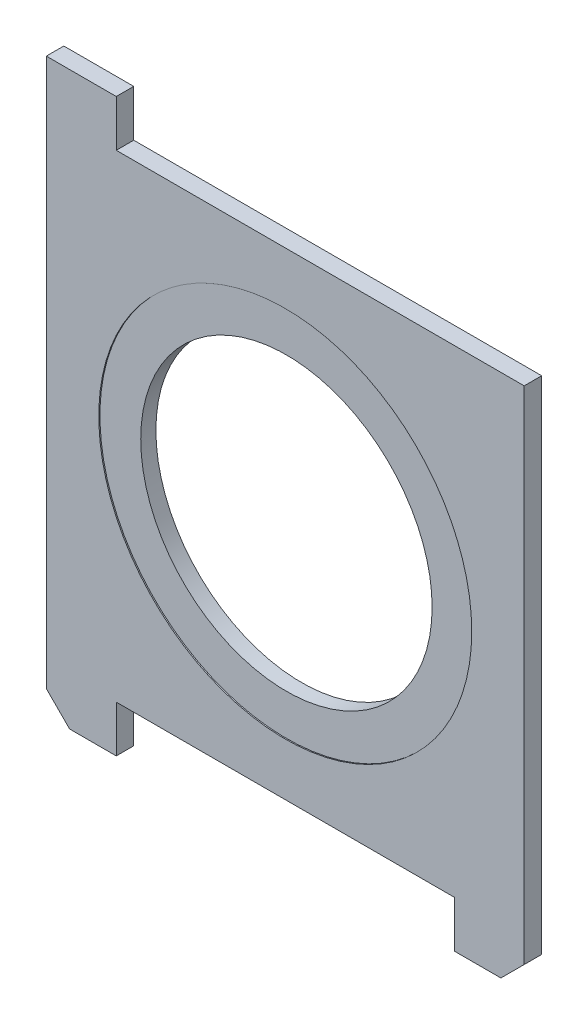
ISO-10303-21;
HEADER;
FILE_DESCRIPTION(('STEP AP214'),'2;1');
FILE_NAME('part.step','',(''),(''),'','','');
FILE_SCHEMA(('AUTOMOTIVE_DESIGN { 1 0 10303 214 1 1 1 1 }'));
ENDSEC;
DATA;
#1=APPLICATION_CONTEXT('core data for automotive mechanical design processes');
#2=APPLICATION_PROTOCOL_DEFINITION('international standard','automotive_design',2000,#1);
#3=PRODUCT_CONTEXT('',#1,'mechanical');
#4=PRODUCT('Part','Part','',(#3));
#5=PRODUCT_RELATED_PRODUCT_CATEGORY('part','',(#4));
#6=PRODUCT_DEFINITION_FORMATION('','',#4);
#7=PRODUCT_DEFINITION_CONTEXT('part definition',#1,'design');
#8=PRODUCT_DEFINITION('design','',#6,#7);
#9=PRODUCT_DEFINITION_SHAPE('','',#8);
#10=(LENGTH_UNIT() NAMED_UNIT(*) SI_UNIT(.MILLI.,.METRE.));
#11=(NAMED_UNIT(*) PLANE_ANGLE_UNIT() SI_UNIT($,.RADIAN.));
#12=(NAMED_UNIT(*) SI_UNIT($,.STERADIAN.) SOLID_ANGLE_UNIT());
#13=UNCERTAINTY_MEASURE_WITH_UNIT(LENGTH_MEASURE(1.E-05),#10,'distance_accuracy_value','');
#14=(GEOMETRIC_REPRESENTATION_CONTEXT(3) GLOBAL_UNCERTAINTY_ASSIGNED_CONTEXT((#13)) GLOBAL_UNIT_ASSIGNED_CONTEXT((#10,
#11,#12)) REPRESENTATION_CONTEXT('',''));
#15=CARTESIAN_POINT('',(0.,0.,0.));
#16=DIRECTION('',(0.,0.,1.));
#17=DIRECTION('',(1.,0.,0.));
#18=AXIS2_PLACEMENT_3D('',#15,#16,#17);
#19=CARTESIAN_POINT('',(0.,0.,1.5));
#20=DIRECTION('',(0.,0.,-1.));
#21=DIRECTION('',(-1.,0.,0.));
#22=AXIS2_PLACEMENT_3D('',#19,#20,#21);
#23=CYLINDRICAL_SURFACE('',#22,12.5);
#24=CARTESIAN_POINT('',(0.,0.,0.1));
#25=DIRECTION('',(0.,0.,-1.));
#26=DIRECTION('',(-1.,0.,0.));
#27=AXIS2_PLACEMENT_3D('',#24,#25,#26);
#28=CIRCLE('',#27,12.5);
#29=CARTESIAN_POINT('',(-12.5,0.,0.1));
#30=VERTEX_POINT('',#29);
#31=EDGE_CURVE('E153',#30,#30,#28,.F.);
#32=ORIENTED_EDGE('',*,*,#31,.F.);
#33=EDGE_LOOP('',(#32));
#34=FACE_BOUND('',#33,.T.);
#35=CARTESIAN_POINT('',(0.,0.,1.4));
#36=DIRECTION('',(0.,0.,1.));
#37=DIRECTION('',(1.,0.,0.));
#38=AXIS2_PLACEMENT_3D('',#35,#36,#37);
#39=CIRCLE('',#38,12.5);
#40=CARTESIAN_POINT('',(12.5,0.,1.4));
#41=VERTEX_POINT('',#40);
#42=EDGE_CURVE('E214',#41,#41,#39,.F.);
#43=ORIENTED_EDGE('',*,*,#42,.F.);
#44=EDGE_LOOP('',(#43));
#45=FACE_BOUND('',#44,.T.);
#46=ADVANCED_FACE('F38',(#34,#45),#23,.F.);
#47=CARTESIAN_POINT('',(-20.5,-20.5,1.5));
#48=DIRECTION('',(0.,1.,0.));
#49=DIRECTION('',(0.,0.,1.));
#50=AXIS2_PLACEMENT_3D('',#47,#48,#49);
#51=PLANE('',#50);
#52=DIRECTION('',(1.,0.,0.));
#53=VECTOR('',#52,1.);
#54=CARTESIAN_POINT('',(-20.5,-20.5,1.5));
#55=LINE('',#54,#53);
#56=CARTESIAN_POINT('',(-14.5,-20.5,1.5));
#57=VERTEX_POINT('',#56);
#58=CARTESIAN_POINT('',(14.5,-20.5,1.5));
#59=VERTEX_POINT('',#58);
#60=EDGE_CURVE('E144',#57,#59,#55,.T.);
#61=ORIENTED_EDGE('',*,*,#60,.F.);
#62=DIRECTION('',(0.,0.,-1.));
#63=VECTOR('',#62,1.);
#64=CARTESIAN_POINT('',(-14.5,-20.5,8.71110255092798));
#65=LINE('',#64,#63);
#66=CARTESIAN_POINT('',(-14.5,-20.5,0.));
#67=VERTEX_POINT('',#66);
#68=EDGE_CURVE('E142',#57,#67,#65,.T.);
#69=ORIENTED_EDGE('',*,*,#68,.T.);
#70=DIRECTION('',(1.,0.,0.));
#71=VECTOR('',#70,1.);
#72=CARTESIAN_POINT('',(-20.5,-20.5,0.));
#73=LINE('',#72,#71);
#74=CARTESIAN_POINT('',(14.5,-20.5,0.));
#75=VERTEX_POINT('',#74);
#76=EDGE_CURVE('E126',#67,#75,#73,.T.);
#77=ORIENTED_EDGE('',*,*,#76,.T.);
#78=DIRECTION('',(0.,0.,-1.));
#79=VECTOR('',#78,1.);
#80=CARTESIAN_POINT('',(14.5,-20.5,8.71110255092798));
#81=LINE('',#80,#79);
#82=EDGE_CURVE('E168',#59,#75,#81,.T.);
#83=ORIENTED_EDGE('',*,*,#82,.F.);
#84=EDGE_LOOP('',(#61,#69,#77,#83));
#85=FACE_BOUND('',#84,.T.);
#86=ADVANCED_FACE('F143',(#85),#51,.F.);
#87=CARTESIAN_POINT('',(-20.5,20.5,1.5));
#88=DIRECTION('',(0.,-1.,0.));
#89=DIRECTION('',(0.,0.,-1.));
#90=AXIS2_PLACEMENT_3D('',#87,#88,#89);
#91=PLANE('',#90);
#92=DIRECTION('',(0.,0.,-1.));
#93=VECTOR('',#92,1.);
#94=CARTESIAN_POINT('',(-14.5,20.5,8.71110255092798));
#95=LINE('',#94,#93);
#96=CARTESIAN_POINT('',(-14.5,20.5,1.5));
#97=VERTEX_POINT('',#96);
#98=CARTESIAN_POINT('',(-14.5,20.5,0.));
#99=VERTEX_POINT('',#98);
#100=EDGE_CURVE('E181',#97,#99,#95,.T.);
#101=ORIENTED_EDGE('',*,*,#100,.F.);
#102=DIRECTION('',(-1.,0.,0.));
#103=VECTOR('',#102,1.);
#104=CARTESIAN_POINT('',(-20.5,20.5,1.5));
#105=LINE('',#104,#103);
#106=CARTESIAN_POINT('',(20.5,20.5,1.5));
#107=VERTEX_POINT('',#106);
#108=EDGE_CURVE('E198',#107,#97,#105,.T.);
#109=ORIENTED_EDGE('',*,*,#108,.F.);
#110=DIRECTION('',(0.,0.,-1.));
#111=VECTOR('',#110,1.);
#112=CARTESIAN_POINT('',(20.5,20.5,1.5));
#113=LINE('',#112,#111);
#114=CARTESIAN_POINT('',(20.5,20.5,0.));
#115=VERTEX_POINT('',#114);
#116=EDGE_CURVE('E205',#107,#115,#113,.T.);
#117=ORIENTED_EDGE('',*,*,#116,.T.);
#118=DIRECTION('',(-1.,0.,0.));
#119=VECTOR('',#118,1.);
#120=CARTESIAN_POINT('',(-20.5,20.5,0.));
#121=LINE('',#120,#119);
#122=EDGE_CURVE('E207',#115,#99,#121,.T.);
#123=ORIENTED_EDGE('',*,*,#122,.T.);
#124=EDGE_LOOP('',(#101,#109,#117,#123));
#125=FACE_BOUND('',#124,.T.);
#126=ADVANCED_FACE('F241',(#125),#91,.F.);
#127=CARTESIAN_POINT('',(20.5,-20.5,1.5));
#128=DIRECTION('',(-1.,0.,0.));
#129=DIRECTION('',(0.,0.,1.));
#130=AXIS2_PLACEMENT_3D('',#127,#128,#129);
#131=PLANE('',#130);
#132=DIRECTION('',(0.,1.,0.));
#133=VECTOR('',#132,1.);
#134=CARTESIAN_POINT('',(20.5,-20.5,1.5));
#135=LINE('',#134,#133);
#136=CARTESIAN_POINT('',(20.5,-22.5,1.5));
#137=VERTEX_POINT('',#136);
#138=EDGE_CURVE('E138',#137,#107,#135,.T.);
#139=ORIENTED_EDGE('',*,*,#138,.F.);
#140=DIRECTION('',(0.,0.,-1.));
#141=VECTOR('',#140,1.);
#142=CARTESIAN_POINT('',(20.5,-22.5,0.));
#143=LINE('',#142,#141);
#144=CARTESIAN_POINT('',(20.5,-22.5,0.));
#145=VERTEX_POINT('',#144);
#146=EDGE_CURVE('E227',#137,#145,#143,.T.);
#147=ORIENTED_EDGE('',*,*,#146,.T.);
#148=DIRECTION('',(0.,1.,0.));
#149=VECTOR('',#148,1.);
#150=CARTESIAN_POINT('',(20.5,-20.5,0.));
#151=LINE('',#150,#149);
#152=EDGE_CURVE('E196',#145,#115,#151,.T.);
#153=ORIENTED_EDGE('',*,*,#152,.T.);
#154=ORIENTED_EDGE('',*,*,#116,.F.);
#155=EDGE_LOOP('',(#139,#147,#153,#154));
#156=FACE_BOUND('',#155,.T.);
#157=ADVANCED_FACE('F233',(#156),#131,.F.);
#158=CARTESIAN_POINT('',(-20.5,-20.5,1.5));
#159=DIRECTION('',(1.,0.,0.));
#160=DIRECTION('',(0.,0.,-1.));
#161=AXIS2_PLACEMENT_3D('',#158,#159,#160);
#162=PLANE('',#161);
#163=DIRECTION('',(0.,-1.,0.));
#164=VECTOR('',#163,1.);
#165=CARTESIAN_POINT('',(-20.5,-20.5,0.));
#166=LINE('',#165,#164);
#167=CARTESIAN_POINT('',(-20.5,24.5,0.));
#168=VERTEX_POINT('',#167);
#169=CARTESIAN_POINT('',(-20.5,-22.5,0.));
#170=VERTEX_POINT('',#169);
#171=EDGE_CURVE('E139',#168,#170,#166,.T.);
#172=ORIENTED_EDGE('',*,*,#171,.T.);
#173=DIRECTION('',(0.,0.,1.));
#174=VECTOR('',#173,1.);
#175=CARTESIAN_POINT('',(-20.5,-22.5,1.5));
#176=LINE('',#175,#174);
#177=CARTESIAN_POINT('',(-20.5,-22.5,1.5));
#178=VERTEX_POINT('',#177);
#179=EDGE_CURVE('E223',#170,#178,#176,.T.);
#180=ORIENTED_EDGE('',*,*,#179,.T.);
#181=DIRECTION('',(0.,-1.,0.));
#182=VECTOR('',#181,1.);
#183=CARTESIAN_POINT('',(-20.5,-20.5,1.5));
#184=LINE('',#183,#182);
#185=CARTESIAN_POINT('',(-20.5,24.5,1.5));
#186=VERTEX_POINT('',#185);
#187=EDGE_CURVE('E201',#186,#178,#184,.T.);
#188=ORIENTED_EDGE('',*,*,#187,.F.);
#189=DIRECTION('',(0.,0.,-1.));
#190=VECTOR('',#189,1.);
#191=CARTESIAN_POINT('',(-20.5,24.5,8.71110255092798));
#192=LINE('',#191,#190);
#193=EDGE_CURVE('E187',#186,#168,#192,.T.);
#194=ORIENTED_EDGE('',*,*,#193,.T.);
#195=EDGE_LOOP('',(#172,#180,#188,#194));
#196=FACE_BOUND('',#195,.T.);
#197=ADVANCED_FACE('F262',(#196),#162,.F.);
#198=CARTESIAN_POINT('',(0.,0.,1.5));
#199=DIRECTION('',(0.,0.,-1.));
#200=DIRECTION('',(-1.,0.,0.));
#201=AXIS2_PLACEMENT_3D('',#198,#199,#200);
#202=PLANE('',#201);
#203=CARTESIAN_POINT('',(0.,0.,1.5));
#204=DIRECTION('',(0.,0.,1.));
#205=DIRECTION('',(1.,0.,0.));
#206=AXIS2_PLACEMENT_3D('',#203,#204,#205);
#207=CIRCLE('',#206,16.);
#208=CARTESIAN_POINT('',(16.,0.,1.5));
#209=VERTEX_POINT('',#208);
#210=EDGE_CURVE('E488',#209,#209,#207,.T.);
#211=ORIENTED_EDGE('',*,*,#210,.F.);
#212=EDGE_LOOP('',(#211));
#213=FACE_BOUND('',#212,.T.);
#214=DIRECTION('',(1.,0.,0.));
#215=VECTOR('',#214,1.);
#216=CARTESIAN_POINT('',(20.5,-24.5,1.5));
#217=LINE('',#216,#215);
#218=CARTESIAN_POINT('',(14.5,-24.5,1.5));
#219=VERTEX_POINT('',#218);
#220=CARTESIAN_POINT('',(18.5,-24.5,1.5));
#221=VERTEX_POINT('',#220);
#222=EDGE_CURVE('E167',#219,#221,#217,.T.);
#223=ORIENTED_EDGE('',*,*,#222,.T.);
#224=DIRECTION('',(0.707106781186549,0.707106781186546,0.));
#225=VECTOR('',#224,1.);
#226=CARTESIAN_POINT('',(20.5,-22.5,1.5));
#227=LINE('',#226,#225);
#228=EDGE_CURVE('E11',#221,#137,#227,.T.);
#229=ORIENTED_EDGE('',*,*,#228,.T.);
#230=ORIENTED_EDGE('',*,*,#138,.T.);
#231=ORIENTED_EDGE('',*,*,#108,.T.);
#232=DIRECTION('',(0.,1.,0.));
#233=VECTOR('',#232,1.);
#234=CARTESIAN_POINT('',(-14.5,20.5,1.5));
#235=LINE('',#234,#233);
#236=CARTESIAN_POINT('',(-14.5,24.5,1.5));
#237=VERTEX_POINT('',#236);
#238=EDGE_CURVE('E178',#97,#237,#235,.T.);
#239=ORIENTED_EDGE('',*,*,#238,.T.);
#240=DIRECTION('',(-1.,0.,0.));
#241=VECTOR('',#240,1.);
#242=CARTESIAN_POINT('',(-20.5,24.5,1.5));
#243=LINE('',#242,#241);
#244=EDGE_CURVE('E180',#237,#186,#243,.T.);
#245=ORIENTED_EDGE('',*,*,#244,.T.);
#246=ORIENTED_EDGE('',*,*,#187,.T.);
#247=DIRECTION('',(0.707106781186546,-0.707106781186549,0.));
#248=VECTOR('',#247,1.);
#249=CARTESIAN_POINT('',(-18.5,-24.5,1.5));
#250=LINE('',#249,#248);
#251=CARTESIAN_POINT('',(-18.5,-24.5,1.5));
#252=VERTEX_POINT('',#251);
#253=EDGE_CURVE('E225',#178,#252,#250,.T.);
#254=ORIENTED_EDGE('',*,*,#253,.T.);
#255=DIRECTION('',(1.,0.,0.));
#256=VECTOR('',#255,1.);
#257=CARTESIAN_POINT('',(-20.5,-24.5,1.5));
#258=LINE('',#257,#256);
#259=CARTESIAN_POINT('',(-14.5,-24.5,1.5));
#260=VERTEX_POINT('',#259);
#261=EDGE_CURVE('E160',#252,#260,#258,.T.);
#262=ORIENTED_EDGE('',*,*,#261,.T.);
#263=DIRECTION('',(0.,1.,0.));
#264=VECTOR('',#263,1.);
#265=CARTESIAN_POINT('',(-14.5,-20.5,1.5));
#266=LINE('',#265,#264);
#267=EDGE_CURVE('E163',#260,#57,#266,.T.);
#268=ORIENTED_EDGE('',*,*,#267,.T.);
#269=ORIENTED_EDGE('',*,*,#60,.T.);
#270=DIRECTION('',(0.,-1.,0.));
#271=VECTOR('',#270,1.);
#272=CARTESIAN_POINT('',(14.5,-20.5,1.5));
#273=LINE('',#272,#271);
#274=EDGE_CURVE('E165',#59,#219,#273,.T.);
#275=ORIENTED_EDGE('',*,*,#274,.T.);
#276=EDGE_LOOP('',(#223,#229,#230,#231,#239,#245,#246,#254,#262,#268,#269,#275));
#277=FACE_BOUND('',#276,.T.);
#278=ADVANCED_FACE('F244',(#213,#277),#202,.F.);
#279=CARTESIAN_POINT('',(0.,0.,0.));
#280=DIRECTION('',(0.,0.,-1.));
#281=DIRECTION('',(-1.,0.,0.));
#282=AXIS2_PLACEMENT_3D('',#279,#280,#281);
#283=PLANE('',#282);
#284=CARTESIAN_POINT('',(0.,0.,0.));
#285=DIRECTION('',(0.,0.,-1.));
#286=DIRECTION('',(-1.,0.,0.));
#287=AXIS2_PLACEMENT_3D('',#284,#285,#286);
#288=CIRCLE('',#287,16.);
#289=CARTESIAN_POINT('',(-16.,0.,0.));
#290=VERTEX_POINT('',#289);
#291=EDGE_CURVE('E217',#290,#290,#288,.T.);
#292=ORIENTED_EDGE('',*,*,#291,.F.);
#293=EDGE_LOOP('',(#292));
#294=FACE_BOUND('',#293,.T.);
#295=ORIENTED_EDGE('',*,*,#152,.F.);
#296=DIRECTION('',(-0.707106781186549,-0.707106781186546,0.));
#297=VECTOR('',#296,1.);
#298=CARTESIAN_POINT('',(21.5,-21.5,0.));
#299=LINE('',#298,#297);
#300=CARTESIAN_POINT('',(18.5,-24.5,0.));
#301=VERTEX_POINT('',#300);
#302=EDGE_CURVE('E61',#145,#301,#299,.T.);
#303=ORIENTED_EDGE('',*,*,#302,.T.);
#304=DIRECTION('',(-1.,0.,0.));
#305=VECTOR('',#304,1.);
#306=CARTESIAN_POINT('',(20.5,-24.5,0.));
#307=LINE('',#306,#305);
#308=CARTESIAN_POINT('',(14.5,-24.5,0.));
#309=VERTEX_POINT('',#308);
#310=EDGE_CURVE('E169',#301,#309,#307,.T.);
#311=ORIENTED_EDGE('',*,*,#310,.T.);
#312=DIRECTION('',(0.,1.,0.));
#313=VECTOR('',#312,1.);
#314=CARTESIAN_POINT('',(14.5,-20.5,0.));
#315=LINE('',#314,#313);
#316=EDGE_CURVE('E134',#309,#75,#315,.T.);
#317=ORIENTED_EDGE('',*,*,#316,.T.);
#318=ORIENTED_EDGE('',*,*,#76,.F.);
#319=DIRECTION('',(0.,-1.,0.));
#320=VECTOR('',#319,1.);
#321=CARTESIAN_POINT('',(-14.5,-20.5,0.));
#322=LINE('',#321,#320);
#323=CARTESIAN_POINT('',(-14.5,-24.5,0.));
#324=VERTEX_POINT('',#323);
#325=EDGE_CURVE('E131',#67,#324,#322,.T.);
#326=ORIENTED_EDGE('',*,*,#325,.T.);
#327=DIRECTION('',(-1.,0.,0.));
#328=VECTOR('',#327,1.);
#329=CARTESIAN_POINT('',(-20.5,-24.5,0.));
#330=LINE('',#329,#328);
#331=CARTESIAN_POINT('',(-18.5,-24.5,0.));
#332=VERTEX_POINT('',#331);
#333=EDGE_CURVE('E149',#324,#332,#330,.T.);
#334=ORIENTED_EDGE('',*,*,#333,.T.);
#335=DIRECTION('',(-0.707106781186546,0.707106781186549,0.));
#336=VECTOR('',#335,1.);
#337=CARTESIAN_POINT('',(-21.5,-21.5,0.));
#338=LINE('',#337,#336);
#339=EDGE_CURVE('E221',#332,#170,#338,.T.);
#340=ORIENTED_EDGE('',*,*,#339,.T.);
#341=ORIENTED_EDGE('',*,*,#171,.F.);
#342=DIRECTION('',(1.,0.,0.));
#343=VECTOR('',#342,1.);
#344=CARTESIAN_POINT('',(-20.5,24.5,0.));
#345=LINE('',#344,#343);
#346=CARTESIAN_POINT('',(-14.5,24.5,0.));
#347=VERTEX_POINT('',#346);
#348=EDGE_CURVE('E177',#168,#347,#345,.T.);
#349=ORIENTED_EDGE('',*,*,#348,.T.);
#350=DIRECTION('',(0.,-1.,0.));
#351=VECTOR('',#350,1.);
#352=CARTESIAN_POINT('',(-14.5,20.5,0.));
#353=LINE('',#352,#351);
#354=EDGE_CURVE('E184',#347,#99,#353,.T.);
#355=ORIENTED_EDGE('',*,*,#354,.T.);
#356=ORIENTED_EDGE('',*,*,#122,.F.);
#357=EDGE_LOOP('',(#295,#303,#311,#317,#318,#326,#334,#340,#341,#349,#355,#356));
#358=FACE_BOUND('',#357,.T.);
#359=ADVANCED_FACE('F128',(#294,#358),#283,.T.);
#360=CARTESIAN_POINT('',(-14.5,20.5,8.71110255092798));
#361=DIRECTION('',(1.,0.,0.));
#362=DIRECTION('',(0.,1.,0.));
#363=AXIS2_PLACEMENT_3D('',#360,#361,#362);
#364=PLANE('',#363);
#365=ORIENTED_EDGE('',*,*,#238,.F.);
#366=ORIENTED_EDGE('',*,*,#100,.T.);
#367=ORIENTED_EDGE('',*,*,#354,.F.);
#368=DIRECTION('',(0.,0.,-1.));
#369=VECTOR('',#368,1.);
#370=CARTESIAN_POINT('',(-14.5,24.5,8.71110255092798));
#371=LINE('',#370,#369);
#372=EDGE_CURVE('E190',#237,#347,#371,.T.);
#373=ORIENTED_EDGE('',*,*,#372,.F.);
#374=EDGE_LOOP('',(#365,#366,#367,#373));
#375=FACE_BOUND('',#374,.T.);
#376=ADVANCED_FACE('F247',(#375),#364,.T.);
#377=CARTESIAN_POINT('',(-20.5,24.5,8.71110255092798));
#378=DIRECTION('',(0.,1.,0.));
#379=DIRECTION('',(0.,0.,1.));
#380=AXIS2_PLACEMENT_3D('',#377,#378,#379);
#381=PLANE('',#380);
#382=ORIENTED_EDGE('',*,*,#244,.F.);
#383=ORIENTED_EDGE('',*,*,#372,.T.);
#384=ORIENTED_EDGE('',*,*,#348,.F.);
#385=ORIENTED_EDGE('',*,*,#193,.F.);
#386=EDGE_LOOP('',(#382,#383,#384,#385));
#387=FACE_BOUND('',#386,.T.);
#388=ADVANCED_FACE('F252',(#387),#381,.T.);
#389=CARTESIAN_POINT('',(14.5,-20.5,8.71110255092798));
#390=DIRECTION('',(-1.,0.,0.));
#391=DIRECTION('',(0.,-1.,0.));
#392=AXIS2_PLACEMENT_3D('',#389,#390,#391);
#393=PLANE('',#392);
#394=ORIENTED_EDGE('',*,*,#274,.F.);
#395=ORIENTED_EDGE('',*,*,#82,.T.);
#396=ORIENTED_EDGE('',*,*,#316,.F.);
#397=DIRECTION('',(0.,0.,-1.));
#398=VECTOR('',#397,1.);
#399=CARTESIAN_POINT('',(14.5,-24.5,8.71110255092798));
#400=LINE('',#399,#398);
#401=EDGE_CURVE('E172',#219,#309,#400,.T.);
#402=ORIENTED_EDGE('',*,*,#401,.F.);
#403=EDGE_LOOP('',(#394,#395,#396,#402));
#404=FACE_BOUND('',#403,.T.);
#405=ADVANCED_FACE('F292',(#404),#393,.T.);
#406=CARTESIAN_POINT('',(20.5,-24.5,8.71110255092798));
#407=DIRECTION('',(0.,-1.,0.));
#408=DIRECTION('',(0.,0.,-1.));
#409=AXIS2_PLACEMENT_3D('',#406,#407,#408);
#410=PLANE('',#409);
#411=ORIENTED_EDGE('',*,*,#310,.F.);
#412=DIRECTION('',(0.,0.,1.));
#413=VECTOR('',#412,1.);
#414=CARTESIAN_POINT('',(18.5,-24.5,1.5));
#415=LINE('',#414,#413);
#416=EDGE_CURVE('E47',#301,#221,#415,.T.);
#417=ORIENTED_EDGE('',*,*,#416,.T.);
#418=ORIENTED_EDGE('',*,*,#222,.F.);
#419=ORIENTED_EDGE('',*,*,#401,.T.);
#420=EDGE_LOOP('',(#411,#417,#418,#419));
#421=FACE_BOUND('',#420,.T.);
#422=ADVANCED_FACE('F288',(#421),#410,.T.);
#423=CARTESIAN_POINT('',(-20.5,-24.5,8.71110255092798));
#424=DIRECTION('',(0.,-1.,0.));
#425=DIRECTION('',(0.,0.,-1.));
#426=AXIS2_PLACEMENT_3D('',#423,#424,#425);
#427=PLANE('',#426);
#428=ORIENTED_EDGE('',*,*,#261,.F.);
#429=DIRECTION('',(0.,0.,-1.));
#430=VECTOR('',#429,1.);
#431=CARTESIAN_POINT('',(-18.5,-24.5,0.));
#432=LINE('',#431,#430);
#433=EDGE_CURVE('E212',#252,#332,#432,.T.);
#434=ORIENTED_EDGE('',*,*,#433,.T.);
#435=ORIENTED_EDGE('',*,*,#333,.F.);
#436=DIRECTION('',(0.,0.,-1.));
#437=VECTOR('',#436,1.);
#438=CARTESIAN_POINT('',(-14.5,-24.5,8.71110255092798));
#439=LINE('',#438,#437);
#440=EDGE_CURVE('E148',#260,#324,#439,.T.);
#441=ORIENTED_EDGE('',*,*,#440,.F.);
#442=EDGE_LOOP('',(#428,#434,#435,#441));
#443=FACE_BOUND('',#442,.T.);
#444=ADVANCED_FACE('F261',(#443),#427,.T.);
#445=CARTESIAN_POINT('',(-14.5,-20.5,8.71110255092798));
#446=DIRECTION('',(1.,0.,0.));
#447=DIRECTION('',(0.,1.,0.));
#448=AXIS2_PLACEMENT_3D('',#445,#446,#447);
#449=PLANE('',#448);
#450=ORIENTED_EDGE('',*,*,#267,.F.);
#451=ORIENTED_EDGE('',*,*,#440,.T.);
#452=ORIENTED_EDGE('',*,*,#325,.F.);
#453=ORIENTED_EDGE('',*,*,#68,.F.);
#454=EDGE_LOOP('',(#450,#451,#452,#453));
#455=FACE_BOUND('',#454,.T.);
#456=ADVANCED_FACE('F151',(#455),#449,.T.);
#457=CARTESIAN_POINT('',(0.,0.,0.1));
#458=DIRECTION('',(0.,0.,-1.));
#459=DIRECTION('',(-1.,0.,0.));
#460=AXIS2_PLACEMENT_3D('',#457,#458,#459);
#461=PLANE('',#460);
#462=CARTESIAN_POINT('',(0.,0.,0.1));
#463=DIRECTION('',(0.,0.,-1.));
#464=DIRECTION('',(-1.,0.,0.));
#465=AXIS2_PLACEMENT_3D('',#462,#463,#464);
#466=CIRCLE('',#465,16.);
#467=CARTESIAN_POINT('',(-16.,0.,0.1));
#468=VERTEX_POINT('',#467);
#469=EDGE_CURVE('E157',#468,#468,#466,.T.);
#470=ORIENTED_EDGE('',*,*,#469,.T.);
#471=EDGE_LOOP('',(#470));
#472=FACE_BOUND('',#471,.T.);
#473=ORIENTED_EDGE('',*,*,#31,.T.);
#474=EDGE_LOOP('',(#473));
#475=FACE_BOUND('',#474,.T.);
#476=ADVANCED_FACE('F291',(#472,#475),#461,.T.);
#477=CARTESIAN_POINT('',(0.,0.,0.1));
#478=DIRECTION('',(0.,0.,-1.));
#479=DIRECTION('',(-1.,0.,0.));
#480=AXIS2_PLACEMENT_3D('',#477,#478,#479);
#481=CYLINDRICAL_SURFACE('',#480,16.);
#482=ORIENTED_EDGE('',*,*,#469,.F.);
#483=EDGE_LOOP('',(#482));
#484=FACE_BOUND('',#483,.T.);
#485=ORIENTED_EDGE('',*,*,#291,.T.);
#486=EDGE_LOOP('',(#485));
#487=FACE_BOUND('',#486,.T.);
#488=ADVANCED_FACE('F284',(#484,#487),#481,.F.);
#489=CARTESIAN_POINT('',(0.,0.,1.4));
#490=DIRECTION('',(0.,0.,1.));
#491=DIRECTION('',(1.,0.,0.));
#492=AXIS2_PLACEMENT_3D('',#489,#490,#491);
#493=PLANE('',#492);
#494=CARTESIAN_POINT('',(0.,0.,1.4));
#495=DIRECTION('',(0.,0.,1.));
#496=DIRECTION('',(1.,0.,0.));
#497=AXIS2_PLACEMENT_3D('',#494,#495,#496);
#498=CIRCLE('',#497,16.);
#499=CARTESIAN_POINT('',(16.,0.,1.4));
#500=VERTEX_POINT('',#499);
#501=EDGE_CURVE('E218',#500,#500,#498,.T.);
#502=ORIENTED_EDGE('',*,*,#501,.T.);
#503=EDGE_LOOP('',(#502));
#504=FACE_BOUND('',#503,.T.);
#505=ORIENTED_EDGE('',*,*,#42,.T.);
#506=EDGE_LOOP('',(#505));
#507=FACE_BOUND('',#506,.T.);
#508=ADVANCED_FACE('F323',(#504,#507),#493,.T.);
#509=CARTESIAN_POINT('',(0.,0.,1.4));
#510=DIRECTION('',(0.,0.,1.));
#511=DIRECTION('',(1.,0.,0.));
#512=AXIS2_PLACEMENT_3D('',#509,#510,#511);
#513=CYLINDRICAL_SURFACE('',#512,16.);
#514=ORIENTED_EDGE('',*,*,#501,.F.);
#515=EDGE_LOOP('',(#514));
#516=FACE_BOUND('',#515,.T.);
#517=ORIENTED_EDGE('',*,*,#210,.T.);
#518=EDGE_LOOP('',(#517));
#519=FACE_BOUND('',#518,.T.);
#520=ADVANCED_FACE('F319',(#516,#519),#513,.F.);
#521=CARTESIAN_POINT('',(-18.5,-24.5,8.71110255092798));
#522=DIRECTION('',(-0.707106781186549,-0.707106781186546,0.));
#523=DIRECTION('',(0.,0.,1.));
#524=AXIS2_PLACEMENT_3D('',#521,#522,#523);
#525=PLANE('',#524);
#526=ORIENTED_EDGE('',*,*,#253,.F.);
#527=ORIENTED_EDGE('',*,*,#179,.F.);
#528=ORIENTED_EDGE('',*,*,#339,.F.);
#529=ORIENTED_EDGE('',*,*,#433,.F.);
#530=EDGE_LOOP('',(#526,#527,#528,#529));
#531=FACE_BOUND('',#530,.T.);
#532=ADVANCED_FACE('F259',(#531),#525,.T.);
#533=CARTESIAN_POINT('',(20.5,-22.5,1.5));
#534=DIRECTION('',(0.707106781186546,-0.707106781186549,0.));
#535=DIRECTION('',(0.,0.,1.));
#536=AXIS2_PLACEMENT_3D('',#533,#534,#535);
#537=PLANE('',#536);
#538=ORIENTED_EDGE('',*,*,#228,.F.);
#539=ORIENTED_EDGE('',*,*,#416,.F.);
#540=ORIENTED_EDGE('',*,*,#302,.F.);
#541=ORIENTED_EDGE('',*,*,#146,.F.);
#542=EDGE_LOOP('',(#538,#539,#540,#541));
#543=FACE_BOUND('',#542,.T.);
#544=ADVANCED_FACE('F41',(#543),#537,.T.);
#545=CLOSED_SHELL('',(#46,#86,#126,#157,#197,#278,#359,#376,#388,#405,#422,#444,#456,#476,#488,
#508,#520,#532,#544));
#546=MANIFOLD_SOLID_BREP('B2',#545);
#547=ADVANCED_BREP_SHAPE_REPRESENTATION('',(#18,#546),#14);
#548=SHAPE_DEFINITION_REPRESENTATION(#9,#547);
ENDSEC;
END-ISO-10303-21;
